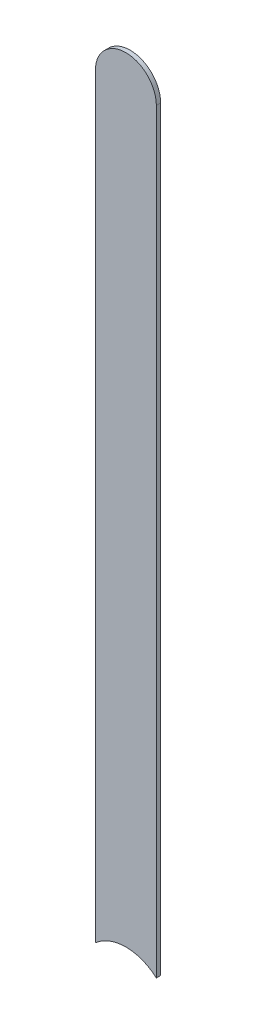
ISO-10303-21;
HEADER;
FILE_DESCRIPTION(('STEP AP214'),'2;1');
FILE_NAME('part.step','',(''),(''),'','','');
FILE_SCHEMA(('AUTOMOTIVE_DESIGN { 1 0 10303 214 1 1 1 1 }'));
ENDSEC;
DATA;
#1=APPLICATION_CONTEXT('core data for automotive mechanical design processes');
#2=APPLICATION_PROTOCOL_DEFINITION('international standard','automotive_design',2000,#1);
#3=PRODUCT_CONTEXT('',#1,'mechanical');
#4=PRODUCT('Part','Part','',(#3));
#5=PRODUCT_RELATED_PRODUCT_CATEGORY('part','',(#4));
#6=PRODUCT_DEFINITION_FORMATION('','',#4);
#7=PRODUCT_DEFINITION_CONTEXT('part definition',#1,'design');
#8=PRODUCT_DEFINITION('design','',#6,#7);
#9=PRODUCT_DEFINITION_SHAPE('','',#8);
#10=(LENGTH_UNIT() NAMED_UNIT(*) SI_UNIT(.MILLI.,.METRE.));
#11=(NAMED_UNIT(*) PLANE_ANGLE_UNIT() SI_UNIT($,.RADIAN.));
#12=(NAMED_UNIT(*) SI_UNIT($,.STERADIAN.) SOLID_ANGLE_UNIT());
#13=UNCERTAINTY_MEASURE_WITH_UNIT(LENGTH_MEASURE(1.E-05),#10,'distance_accuracy_value','');
#14=(GEOMETRIC_REPRESENTATION_CONTEXT(3) GLOBAL_UNCERTAINTY_ASSIGNED_CONTEXT((#13)) GLOBAL_UNIT_ASSIGNED_CONTEXT((#10,
#11,#12)) REPRESENTATION_CONTEXT('',''));
#15=CARTESIAN_POINT('',(0.,0.,0.));
#16=DIRECTION('',(0.,0.,1.));
#17=DIRECTION('',(1.,0.,0.));
#18=AXIS2_PLACEMENT_3D('',#15,#16,#17);
#19=CARTESIAN_POINT('',(166.247,-127.,-0.035));
#20=DIRECTION('',(1.,0.,0.));
#21=DIRECTION('',(0.,1.,0.));
#22=AXIS2_PLACEMENT_3D('',#19,#20,#21);
#23=PLANE('',#22);
#24=DIRECTION('',(0.,0.,-1.));
#25=VECTOR('',#24,1.);
#26=CARTESIAN_POINT('',(166.247,-133.1974915028,-0.045));
#27=LINE('',#26,#25);
#28=CARTESIAN_POINT('',(166.247,-133.1974915028,0.));
#29=VERTEX_POINT('',#28);
#30=CARTESIAN_POINT('',(166.247,-133.1974915028,-0.035));
#31=VERTEX_POINT('',#30);
#32=EDGE_CURVE('E11',#29,#31,#27,.T.);
#33=ORIENTED_EDGE('',*,*,#32,.F.);
#34=DIRECTION('',(0.,-1.,0.));
#35=VECTOR('',#34,1.);
#36=CARTESIAN_POINT('',(166.247,-127.,0.));
#37=LINE('',#36,#35);
#38=CARTESIAN_POINT('',(166.247,-127.,0.));
#39=VERTEX_POINT('',#38);
#40=EDGE_CURVE('E21',#39,#29,#37,.T.);
#41=ORIENTED_EDGE('',*,*,#40,.F.);
#42=DIRECTION('',(0.,0.,1.));
#43=VECTOR('',#42,1.);
#44=CARTESIAN_POINT('',(166.247,-127.,-0.035));
#45=LINE('',#44,#43);
#46=CARTESIAN_POINT('',(166.247,-127.,-0.035));
#47=VERTEX_POINT('',#46);
#48=EDGE_CURVE('E110',#47,#39,#45,.T.);
#49=ORIENTED_EDGE('',*,*,#48,.F.);
#50=DIRECTION('',(0.,-1.,0.));
#51=VECTOR('',#50,1.);
#52=CARTESIAN_POINT('',(166.247,-127.,-0.035));
#53=LINE('',#52,#51);
#54=EDGE_CURVE('E76',#47,#31,#53,.T.);
#55=ORIENTED_EDGE('',*,*,#54,.T.);
#56=EDGE_LOOP('',(#33,#41,#49,#55));
#57=FACE_BOUND('',#56,.T.);
#58=ADVANCED_FACE('F17',(#57),#23,.F.);
#59=CARTESIAN_POINT('',(166.497,-133.477,-0.045));
#60=DIRECTION('',(0.,0.,-1.));
#61=DIRECTION('',(0.,-1.,0.));
#62=AXIS2_PLACEMENT_3D('',#59,#60,#61);
#63=CYLINDRICAL_SURFACE('',#62,0.375);
#64=DIRECTION('',(0.,0.,-1.));
#65=VECTOR('',#64,1.);
#66=CARTESIAN_POINT('',(166.747,-133.1974915028,-0.045));
#67=LINE('',#66,#65);
#68=CARTESIAN_POINT('',(166.747,-133.1974915028,0.));
#69=VERTEX_POINT('',#68);
#70=CARTESIAN_POINT('',(166.747,-133.1974915028,-0.035));
#71=VERTEX_POINT('',#70);
#72=EDGE_CURVE('E89',#69,#71,#67,.T.);
#73=ORIENTED_EDGE('',*,*,#72,.F.);
#74=CARTESIAN_POINT('',(166.497,-133.477,0.));
#75=DIRECTION('',(0.,0.,-1.));
#76=DIRECTION('',(0.,-1.,0.));
#77=AXIS2_PLACEMENT_3D('',#74,#75,#76);
#78=CIRCLE('',#77,0.375);
#79=EDGE_CURVE('E113',#29,#69,#78,.T.);
#80=ORIENTED_EDGE('',*,*,#79,.F.);
#81=ORIENTED_EDGE('',*,*,#32,.T.);
#82=CARTESIAN_POINT('',(166.497,-133.477,-0.035));
#83=DIRECTION('',(0.,0.,-1.));
#84=DIRECTION('',(0.,-1.,0.));
#85=AXIS2_PLACEMENT_3D('',#82,#83,#84);
#86=CIRCLE('',#85,0.375);
#87=EDGE_CURVE('E81',#31,#71,#86,.T.);
#88=ORIENTED_EDGE('',*,*,#87,.T.);
#89=EDGE_LOOP('',(#73,#80,#81,#88));
#90=FACE_BOUND('',#89,.T.);
#91=ADVANCED_FACE('F19',(#90),#63,.F.);
#92=CARTESIAN_POINT('',(166.747,-133.477,0.));
#93=DIRECTION('',(0.,0.,1.));
#94=DIRECTION('',(1.,0.,0.));
#95=AXIS2_PLACEMENT_3D('',#92,#93,#94);
#96=PLANE('',#95);
#97=ORIENTED_EDGE('',*,*,#79,.T.);
#98=DIRECTION('',(0.,1.,0.));
#99=VECTOR('',#98,1.);
#100=CARTESIAN_POINT('',(166.747,-133.477,0.));
#101=LINE('',#100,#99);
#102=CARTESIAN_POINT('',(166.747,-127.,0.));
#103=VERTEX_POINT('',#102);
#104=EDGE_CURVE('E96',#69,#103,#101,.T.);
#105=ORIENTED_EDGE('',*,*,#104,.T.);
#106=CARTESIAN_POINT('',(166.497,-127.,0.));
#107=DIRECTION('',(0.,0.,1.));
#108=DIRECTION('',(1.,0.,0.));
#109=AXIS2_PLACEMENT_3D('',#106,#107,#108);
#110=CIRCLE('',#109,0.25);
#111=EDGE_CURVE('E93',#103,#39,#110,.T.);
#112=ORIENTED_EDGE('',*,*,#111,.T.);
#113=ORIENTED_EDGE('',*,*,#40,.T.);
#114=EDGE_LOOP('',(#97,#105,#112,#113));
#115=FACE_BOUND('',#114,.T.);
#116=ADVANCED_FACE('F119',(#115),#96,.T.);
#117=CARTESIAN_POINT('',(166.497,-127.,-0.035));
#118=DIRECTION('',(0.,0.,-1.));
#119=DIRECTION('',(1.,0.,0.));
#120=AXIS2_PLACEMENT_3D('',#117,#118,#119);
#121=CYLINDRICAL_SURFACE('',#120,0.25);
#122=CARTESIAN_POINT('',(166.497,-127.,-0.035));
#123=DIRECTION('',(0.,0.,1.));
#124=DIRECTION('',(1.,0.,0.));
#125=AXIS2_PLACEMENT_3D('',#122,#123,#124);
#126=CIRCLE('',#125,0.25);
#127=CARTESIAN_POINT('',(166.747,-127.,-0.035));
#128=VERTEX_POINT('',#127);
#129=EDGE_CURVE('E70',#128,#47,#126,.T.);
#130=ORIENTED_EDGE('',*,*,#129,.T.);
#131=ORIENTED_EDGE('',*,*,#48,.T.);
#132=ORIENTED_EDGE('',*,*,#111,.F.);
#133=DIRECTION('',(0.,0.,1.));
#134=VECTOR('',#133,1.);
#135=CARTESIAN_POINT('',(166.747,-127.,-0.035));
#136=LINE('',#135,#134);
#137=EDGE_CURVE('E87',#128,#103,#136,.T.);
#138=ORIENTED_EDGE('',*,*,#137,.F.);
#139=EDGE_LOOP('',(#130,#131,#132,#138));
#140=FACE_BOUND('',#139,.T.);
#141=ADVANCED_FACE('F92',(#140),#121,.T.);
#142=CARTESIAN_POINT('',(166.747,-133.477,-0.035));
#143=DIRECTION('',(0.,0.,1.));
#144=DIRECTION('',(1.,0.,0.));
#145=AXIS2_PLACEMENT_3D('',#142,#143,#144);
#146=PLANE('',#145);
#147=ORIENTED_EDGE('',*,*,#54,.F.);
#148=ORIENTED_EDGE('',*,*,#129,.F.);
#149=DIRECTION('',(0.,1.,0.));
#150=VECTOR('',#149,1.);
#151=CARTESIAN_POINT('',(166.747,-133.477,-0.035));
#152=LINE('',#151,#150);
#153=EDGE_CURVE('E74',#71,#128,#152,.T.);
#154=ORIENTED_EDGE('',*,*,#153,.F.);
#155=ORIENTED_EDGE('',*,*,#87,.F.);
#156=EDGE_LOOP('',(#147,#148,#154,#155));
#157=FACE_BOUND('',#156,.T.);
#158=ADVANCED_FACE('F72',(#157),#146,.F.);
#159=CARTESIAN_POINT('',(166.747,-133.477,-0.035));
#160=DIRECTION('',(-1.,0.,0.));
#161=DIRECTION('',(0.,0.,1.));
#162=AXIS2_PLACEMENT_3D('',#159,#160,#161);
#163=PLANE('',#162);
#164=ORIENTED_EDGE('',*,*,#137,.T.);
#165=ORIENTED_EDGE('',*,*,#104,.F.);
#166=ORIENTED_EDGE('',*,*,#72,.T.);
#167=ORIENTED_EDGE('',*,*,#153,.T.);
#168=EDGE_LOOP('',(#164,#165,#166,#167));
#169=FACE_BOUND('',#168,.T.);
#170=ADVANCED_FACE('F85',(#169),#163,.F.);
#171=CLOSED_SHELL('',(#58,#91,#116,#141,#158,#170));
#172=MANIFOLD_SOLID_BREP('B1',#171);
#173=ADVANCED_BREP_SHAPE_REPRESENTATION('',(#18,#172),#14);
#174=SHAPE_DEFINITION_REPRESENTATION(#9,#173);
ENDSEC;
END-ISO-10303-21;
